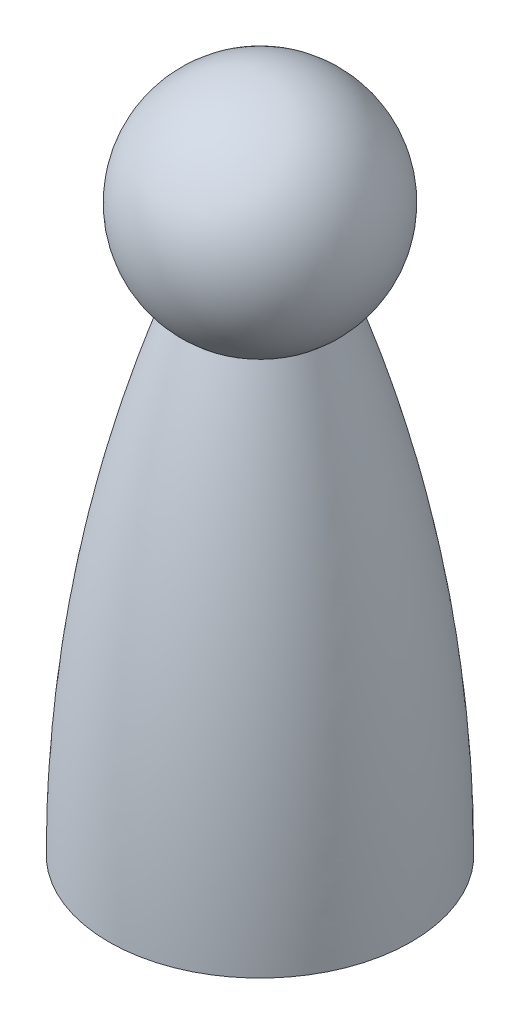
ISO-10303-21;
HEADER;
FILE_DESCRIPTION(('STEP AP214'),'2;1');
FILE_NAME('part.step','',(''),(''),'','','');
FILE_SCHEMA(('AUTOMOTIVE_DESIGN { 1 0 10303 214 1 1 1 1 }'));
ENDSEC;
DATA;
#1=APPLICATION_CONTEXT('core data for automotive mechanical design processes');
#2=APPLICATION_PROTOCOL_DEFINITION('international standard','automotive_design',2000,#1);
#3=PRODUCT_CONTEXT('',#1,'mechanical');
#4=PRODUCT('Part','Part','',(#3));
#5=PRODUCT_RELATED_PRODUCT_CATEGORY('part','',(#4));
#6=PRODUCT_DEFINITION_FORMATION('','',#4);
#7=PRODUCT_DEFINITION_CONTEXT('part definition',#1,'design');
#8=PRODUCT_DEFINITION('design','',#6,#7);
#9=PRODUCT_DEFINITION_SHAPE('','',#8);
#10=(LENGTH_UNIT() NAMED_UNIT(*) SI_UNIT(.MILLI.,.METRE.));
#11=(NAMED_UNIT(*) PLANE_ANGLE_UNIT() SI_UNIT($,.RADIAN.));
#12=(NAMED_UNIT(*) SI_UNIT($,.STERADIAN.) SOLID_ANGLE_UNIT());
#13=UNCERTAINTY_MEASURE_WITH_UNIT(LENGTH_MEASURE(1.E-05),#10,'distance_accuracy_value','');
#14=(GEOMETRIC_REPRESENTATION_CONTEXT(3) GLOBAL_UNCERTAINTY_ASSIGNED_CONTEXT((#13)) GLOBAL_UNIT_ASSIGNED_CONTEXT((#10,
#11,#12)) REPRESENTATION_CONTEXT('',''));
#15=CARTESIAN_POINT('',(0.,0.,0.));
#16=DIRECTION('',(0.,0.,1.));
#17=DIRECTION('',(1.,0.,0.));
#18=AXIS2_PLACEMENT_3D('',#15,#16,#17);
#19=CARTESIAN_POINT('',(0.,0.,0.));
#20=DIRECTION('',(0.,-1.,0.));
#21=DIRECTION('',(0.,0.,-1.));
#22=AXIS2_PLACEMENT_3D('',#19,#20,#21);
#23=PLANE('',#22);
#24=CARTESIAN_POINT('',(0.,0.,0.));
#25=DIRECTION('',(0.,-1.,0.));
#26=DIRECTION('',(0.,0.,-1.));
#27=AXIS2_PLACEMENT_3D('',#24,#25,#26);
#28=CIRCLE('',#27,12.7);
#29=CARTESIAN_POINT('',(0.,0.,-12.7));
#30=VERTEX_POINT('',#29);
#31=EDGE_CURVE('E12',#30,#30,#28,.T.);
#32=ORIENTED_EDGE('',*,*,#31,.T.);
#33=EDGE_LOOP('',(#32));
#34=FACE_BOUND('',#33,.T.);
#35=ADVANCED_FACE('F51',(#34),#23,.T.);
#36=CARTESIAN_POINT('',(0.,0.,0.));
#37=DIRECTION('',(0.,-1.,0.));
#38=DIRECTION('',(0.,0.,-1.));
#39=AXIS2_PLACEMENT_3D('',#36,#37,#38);
#40=CYLINDRICAL_SURFACE('',#39,12.7);
#41=CARTESIAN_POINT('',(0.,3.81000000000004,0.));
#42=DIRECTION('',(0.,-1.,0.));
#43=DIRECTION('',(0.,0.,-1.));
#44=AXIS2_PLACEMENT_3D('',#41,#42,#43);
#45=CIRCLE('',#44,12.7);
#46=CARTESIAN_POINT('',(0.,3.81000000000004,-12.7));
#47=VERTEX_POINT('',#46);
#48=EDGE_CURVE('E58',#47,#47,#45,.T.);
#49=ORIENTED_EDGE('',*,*,#48,.T.);
#50=EDGE_LOOP('',(#49));
#51=FACE_BOUND('',#50,.T.);
#52=ORIENTED_EDGE('',*,*,#31,.F.);
#53=EDGE_LOOP('',(#52));
#54=FACE_BOUND('',#53,.T.);
#55=ADVANCED_FACE('F91',(#51,#54),#40,.T.);
#56=CARTESIAN_POINT('',(0.,3.81000000000004,0.));
#57=DIRECTION('',(0.,-1.,0.));
#58=DIRECTION('',(0.,0.,-1.));
#59=AXIS2_PLACEMENT_3D('',#56,#57,#58);
#60=PLANE('',#59);
#61=CARTESIAN_POINT('',(0.,3.81000000000004,0.));
#62=DIRECTION('',(0.,-1.,0.));
#63=DIRECTION('',(0.,0.,-1.));
#64=AXIS2_PLACEMENT_3D('',#61,#62,#63);
#65=CIRCLE('',#64,19.05);
#66=CARTESIAN_POINT('',(0.,3.81000000000004,-19.0500000000001));
#67=VERTEX_POINT('',#66);
#68=EDGE_CURVE('E64',#67,#67,#65,.T.);
#69=ORIENTED_EDGE('',*,*,#68,.T.);
#70=EDGE_LOOP('',(#69));
#71=FACE_BOUND('',#70,.T.);
#72=ORIENTED_EDGE('',*,*,#48,.F.);
#73=EDGE_LOOP('',(#72));
#74=FACE_BOUND('',#73,.T.);
#75=ADVANCED_FACE('F88',(#71,#74),#60,.T.);
#76=CARTESIAN_POINT('',(0.,3.81000000000003,-19.05));
#77=CARTESIAN_POINT('',(0.,34.8743329839227,-18.960707090638));
#78=CARTESIAN_POINT('',(0.,63.9676153003103,-8.65950470269572));
#79=B_SPLINE_CURVE_WITH_KNOTS('',2,(#76,#77,#78),.UNSPECIFIED.,.F.,.F.,(3,3),(0.,1.),.UNSPECIFIED.);
#80=CARTESIAN_POINT('',(0.,0.,0.));
#81=DIRECTION('',(0.,-1.,0.));
#82=AXIS1_PLACEMENT('',#80,#81);
#83=SURFACE_OF_REVOLUTION('',#79,#82);
#84=CARTESIAN_POINT('',(0.,63.9676153003104,0.));
#85=DIRECTION('',(0.,-1.,0.));
#86=DIRECTION('',(0.,0.,-1.));
#87=AXIS2_PLACEMENT_3D('',#84,#85,#86);
#88=CIRCLE('',#87,8.65950470269567);
#89=CARTESIAN_POINT('',(0.,63.9676153003104,-8.6595047026957));
#90=VERTEX_POINT('',#89);
#91=EDGE_CURVE('E70',#90,#90,#88,.T.);
#92=ORIENTED_EDGE('',*,*,#91,.T.);
#93=EDGE_LOOP('',(#92));
#94=FACE_BOUND('',#93,.T.);
#95=ORIENTED_EDGE('',*,*,#68,.F.);
#96=EDGE_LOOP('',(#95));
#97=FACE_BOUND('',#96,.T.);
#98=ADVANCED_FACE('F83',(#94,#97),#83,.F.);
#99=CARTESIAN_POINT('',(0.,74.9300000000001,0.));
#100=DIRECTION('',(0.,-1.,0.));
#101=DIRECTION('',(0.,0.,-1.));
#102=AXIS2_PLACEMENT_3D('',#99,#100,#101);
#103=SPHERICAL_SURFACE('',#102,13.97);
#104=ORIENTED_EDGE('',*,*,#91,.F.);
#105=EDGE_LOOP('',(#104));
#106=FACE_BOUND('',#105,.T.);
#107=ADVANCED_FACE('F87',(#106),#103,.T.);
#108=CLOSED_SHELL('',(#35,#55,#75,#98,#107));
#109=MANIFOLD_SOLID_BREP('B2',#108);
#110=ADVANCED_BREP_SHAPE_REPRESENTATION('',(#18,#109),#14);
#111=SHAPE_DEFINITION_REPRESENTATION(#9,#110);
ENDSEC;
END-ISO-10303-21;
